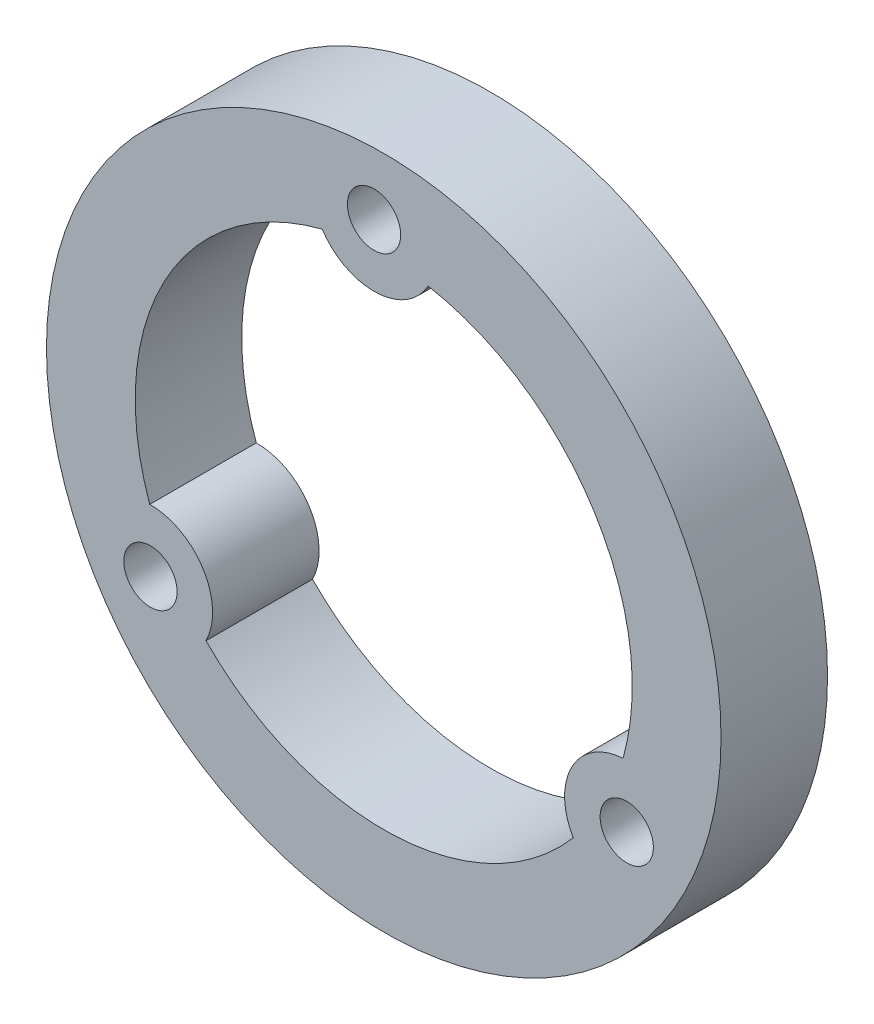
ISO-10303-21;
HEADER;
FILE_DESCRIPTION(('STEP AP214'),'2;1');
FILE_NAME('part.step','',(''),(''),'','','');
FILE_SCHEMA(('AUTOMOTIVE_DESIGN { 1 0 10303 214 1 1 1 1 }'));
ENDSEC;
DATA;
#1=APPLICATION_CONTEXT('core data for automotive mechanical design processes');
#2=APPLICATION_PROTOCOL_DEFINITION('international standard','automotive_design',2000,#1);
#3=PRODUCT_CONTEXT('',#1,'mechanical');
#4=PRODUCT('Part','Part','',(#3));
#5=PRODUCT_RELATED_PRODUCT_CATEGORY('part','',(#4));
#6=PRODUCT_DEFINITION_FORMATION('','',#4);
#7=PRODUCT_DEFINITION_CONTEXT('part definition',#1,'design');
#8=PRODUCT_DEFINITION('design','',#6,#7);
#9=PRODUCT_DEFINITION_SHAPE('','',#8);
#10=(LENGTH_UNIT() NAMED_UNIT(*) SI_UNIT(.MILLI.,.METRE.));
#11=(NAMED_UNIT(*) PLANE_ANGLE_UNIT() SI_UNIT($,.RADIAN.));
#12=(NAMED_UNIT(*) SI_UNIT($,.STERADIAN.) SOLID_ANGLE_UNIT());
#13=UNCERTAINTY_MEASURE_WITH_UNIT(LENGTH_MEASURE(1.E-05),#10,'distance_accuracy_value','');
#14=(GEOMETRIC_REPRESENTATION_CONTEXT(3) GLOBAL_UNCERTAINTY_ASSIGNED_CONTEXT((#13)) GLOBAL_UNIT_ASSIGNED_CONTEXT((#10,
#11,#12)) REPRESENTATION_CONTEXT('',''));
#15=CARTESIAN_POINT('',(0.,0.,0.));
#16=DIRECTION('',(0.,0.,1.));
#17=DIRECTION('',(1.,0.,0.));
#18=AXIS2_PLACEMENT_3D('',#15,#16,#17);
#19=CARTESIAN_POINT('',(0.,0.,6.));
#20=DIRECTION('',(0.,0.,1.));
#21=DIRECTION('',(1.,0.,0.));
#22=AXIS2_PLACEMENT_3D('',#19,#20,#21);
#23=PLANE('',#22);
#24=CARTESIAN_POINT('',(-13.1416847795504,-8.21864472738256,6.));
#25=DIRECTION('',(0.,0.,1.));
#26=DIRECTION('',(1.,0.,0.));
#27=AXIS2_PLACEMENT_3D('',#24,#25,#26);
#28=CIRCLE('',#27,1.5);
#29=CARTESIAN_POINT('',(-11.6416847795504,-8.21864472738256,6.));
#30=VERTEX_POINT('',#29);
#31=EDGE_CURVE('E246',#30,#30,#28,.T.);
#32=ORIENTED_EDGE('',*,*,#31,.F.);
#33=EDGE_LOOP('',(#32));
#34=FACE_BOUND('',#33,.T.);
#35=CARTESIAN_POINT('',(13.6883975083675,-7.2717105039268,6.));
#36=DIRECTION('',(0.,0.,-1.));
#37=DIRECTION('',(1.,0.,0.));
#38=AXIS2_PLACEMENT_3D('',#35,#36,#37);
#39=CIRCLE('',#38,3.5);
#40=CARTESIAN_POINT('',(10.6770331705431,-9.0554382928228,6.));
#41=VERTEX_POINT('',#40);
#42=CARTESIAN_POINT('',(13.4806381865757,-3.77788222191169,6.));
#43=VERTEX_POINT('',#42);
#44=EDGE_CURVE('E93',#41,#43,#39,.T.);
#45=ORIENTED_EDGE('',*,*,#44,.F.);
#46=CARTESIAN_POINT('',(0.,0.,6.));
#47=DIRECTION('',(0.,0.,1.));
#48=DIRECTION('',(1.,0.,0.));
#49=AXIS2_PLACEMENT_3D('',#46,#47,#48);
#50=CIRCLE('',#49,14.);
#51=CARTESIAN_POINT('',(-10.0120610699689,-9.78563401784541,6.));
#52=VERTEX_POINT('',#51);
#53=EDGE_CURVE('E85',#52,#41,#50,.T.);
#54=ORIENTED_EDGE('',*,*,#53,.F.);
#55=CARTESIAN_POINT('',(-13.1416847795504,-8.21864472738256,6.));
#56=DIRECTION('',(0.,0.,-1.));
#57=DIRECTION('',(1.,0.,0.));
#58=AXIS2_PLACEMENT_3D('',#55,#56,#57);
#59=CIRCLE('',#58,3.5);
#60=CARTESIAN_POINT('',(-13.1807561892585,-4.71886281632819,6.));
#61=VERTEX_POINT('',#60);
#62=EDGE_CURVE('E115',#61,#52,#59,.T.);
#63=ORIENTED_EDGE('',*,*,#62,.F.);
#64=CARTESIAN_POINT('',(0.,0.,6.));
#65=DIRECTION('',(0.,0.,1.));
#66=DIRECTION('',(1.,0.,0.));
#67=AXIS2_PLACEMENT_3D('',#64,#65,#66);
#68=CIRCLE('',#67,14.);
#69=CARTESIAN_POINT('',(-3.46857711660661,13.563516239757,6.));
#70=VERTEX_POINT('',#69);
#71=EDGE_CURVE('E113',#70,#61,#68,.T.);
#72=ORIENTED_EDGE('',*,*,#71,.F.);
#73=CARTESIAN_POINT('',(-0.546712728816841,15.4903552313092,6.));
#74=DIRECTION('',(0.,0.,-1.));
#75=DIRECTION('',(1.,0.,0.));
#76=AXIS2_PLACEMENT_3D('',#73,#74,#75);
#77=CIRCLE('',#76,3.5);
#78=CARTESIAN_POINT('',(2.5037230187155,13.7743011091508,6.));
#79=VERTEX_POINT('',#78);
#80=EDGE_CURVE('E108',#79,#70,#77,.T.);
#81=ORIENTED_EDGE('',*,*,#80,.F.);
#82=CARTESIAN_POINT('',(0.,0.,6.));
#83=DIRECTION('',(0.,0.,1.));
#84=DIRECTION('',(1.,0.,0.));
#85=AXIS2_PLACEMENT_3D('',#82,#83,#84);
#86=CIRCLE('',#85,14.);
#87=EDGE_CURVE('E106',#43,#79,#86,.T.);
#88=ORIENTED_EDGE('',*,*,#87,.F.);
#89=EDGE_LOOP('',(#45,#54,#63,#72,#81,#88));
#90=FACE_BOUND('',#89,.T.);
#91=CARTESIAN_POINT('',(0.,0.,6.));
#92=DIRECTION('',(0.,0.,1.));
#93=DIRECTION('',(1.,0.,0.));
#94=AXIS2_PLACEMENT_3D('',#91,#92,#93);
#95=CIRCLE('',#94,19.);
#96=CARTESIAN_POINT('',(19.,0.,6.));
#97=VERTEX_POINT('',#96);
#98=EDGE_CURVE('E11',#97,#97,#95,.T.);
#99=ORIENTED_EDGE('',*,*,#98,.T.);
#100=EDGE_LOOP('',(#99));
#101=FACE_BOUND('',#100,.T.);
#102=CARTESIAN_POINT('',(-0.546712728816841,15.4903552313092,6.));
#103=DIRECTION('',(0.,0.,1.));
#104=DIRECTION('',(1.,0.,0.));
#105=AXIS2_PLACEMENT_3D('',#102,#103,#104);
#106=CIRCLE('',#105,1.5);
#107=CARTESIAN_POINT('',(0.953287271183161,15.4903552313092,6.));
#108=VERTEX_POINT('',#107);
#109=EDGE_CURVE('E118',#108,#108,#106,.T.);
#110=ORIENTED_EDGE('',*,*,#109,.F.);
#111=EDGE_LOOP('',(#110));
#112=FACE_BOUND('',#111,.T.);
#113=CARTESIAN_POINT('',(13.6883975083675,-7.2717105039268,6.));
#114=DIRECTION('',(0.,0.,1.));
#115=DIRECTION('',(1.,0.,0.));
#116=AXIS2_PLACEMENT_3D('',#113,#114,#115);
#117=CIRCLE('',#116,1.5);
#118=CARTESIAN_POINT('',(15.1883975083675,-7.2717105039268,6.));
#119=VERTEX_POINT('',#118);
#120=EDGE_CURVE('E237',#119,#119,#117,.T.);
#121=ORIENTED_EDGE('',*,*,#120,.F.);
#122=EDGE_LOOP('',(#121));
#123=FACE_BOUND('',#122,.T.);
#124=ADVANCED_FACE('F32',(#34,#90,#101,#112,#123),#23,.T.);
#125=CARTESIAN_POINT('',(0.,0.,0.));
#126=DIRECTION('',(0.,0.,1.));
#127=DIRECTION('',(1.,0.,0.));
#128=AXIS2_PLACEMENT_3D('',#125,#126,#127);
#129=PLANE('',#128);
#130=CARTESIAN_POINT('',(0.,0.,0.));
#131=DIRECTION('',(0.,0.,1.));
#132=DIRECTION('',(1.,0.,0.));
#133=AXIS2_PLACEMENT_3D('',#130,#131,#132);
#134=CIRCLE('',#133,19.);
#135=CARTESIAN_POINT('',(19.,0.,0.));
#136=VERTEX_POINT('',#135);
#137=EDGE_CURVE('E36',#136,#136,#134,.T.);
#138=ORIENTED_EDGE('',*,*,#137,.F.);
#139=EDGE_LOOP('',(#138));
#140=FACE_BOUND('',#139,.T.);
#141=CARTESIAN_POINT('',(0.,0.,0.));
#142=DIRECTION('',(0.,0.,1.));
#143=DIRECTION('',(1.,0.,0.));
#144=AXIS2_PLACEMENT_3D('',#141,#142,#143);
#145=CIRCLE('',#144,14.);
#146=CARTESIAN_POINT('',(-10.0120610699689,-9.78563401784541,0.));
#147=VERTEX_POINT('',#146);
#148=CARTESIAN_POINT('',(10.6770331705431,-9.0554382928228,0.));
#149=VERTEX_POINT('',#148);
#150=EDGE_CURVE('E55',#147,#149,#145,.T.);
#151=ORIENTED_EDGE('',*,*,#150,.T.);
#152=CARTESIAN_POINT('',(13.6883975083675,-7.2717105039268,0.));
#153=DIRECTION('',(0.,0.,-1.));
#154=DIRECTION('',(1.,0.,0.));
#155=AXIS2_PLACEMENT_3D('',#152,#153,#154);
#156=CIRCLE('',#155,3.5);
#157=CARTESIAN_POINT('',(13.4806381865757,-3.77788222191169,0.));
#158=VERTEX_POINT('',#157);
#159=EDGE_CURVE('E100',#149,#158,#156,.T.);
#160=ORIENTED_EDGE('',*,*,#159,.T.);
#161=CARTESIAN_POINT('',(0.,0.,0.));
#162=DIRECTION('',(0.,0.,1.));
#163=DIRECTION('',(1.,0.,0.));
#164=AXIS2_PLACEMENT_3D('',#161,#162,#163);
#165=CIRCLE('',#164,14.);
#166=CARTESIAN_POINT('',(2.5037230187155,13.7743011091508,0.));
#167=VERTEX_POINT('',#166);
#168=EDGE_CURVE('E120',#158,#167,#165,.T.);
#169=ORIENTED_EDGE('',*,*,#168,.T.);
#170=CARTESIAN_POINT('',(-0.546712728816841,15.4903552313092,0.));
#171=DIRECTION('',(0.,0.,-1.));
#172=DIRECTION('',(1.,0.,0.));
#173=AXIS2_PLACEMENT_3D('',#170,#171,#172);
#174=CIRCLE('',#173,3.5);
#175=CARTESIAN_POINT('',(-3.46857711660661,13.563516239757,0.));
#176=VERTEX_POINT('',#175);
#177=EDGE_CURVE('E123',#167,#176,#174,.T.);
#178=ORIENTED_EDGE('',*,*,#177,.T.);
#179=CARTESIAN_POINT('',(0.,0.,0.));
#180=DIRECTION('',(0.,0.,1.));
#181=DIRECTION('',(1.,0.,0.));
#182=AXIS2_PLACEMENT_3D('',#179,#180,#181);
#183=CIRCLE('',#182,14.);
#184=CARTESIAN_POINT('',(-13.1807561892585,-4.71886281632818,0.));
#185=VERTEX_POINT('',#184);
#186=EDGE_CURVE('E126',#176,#185,#183,.T.);
#187=ORIENTED_EDGE('',*,*,#186,.T.);
#188=CARTESIAN_POINT('',(-13.1416847795504,-8.21864472738256,0.));
#189=DIRECTION('',(0.,0.,-1.));
#190=DIRECTION('',(1.,0.,0.));
#191=AXIS2_PLACEMENT_3D('',#188,#189,#190);
#192=CIRCLE('',#191,3.5);
#193=EDGE_CURVE('E94',#185,#147,#192,.T.);
#194=ORIENTED_EDGE('',*,*,#193,.T.);
#195=EDGE_LOOP('',(#151,#160,#169,#178,#187,#194));
#196=FACE_BOUND('',#195,.T.);
#197=CARTESIAN_POINT('',(-0.546712728816841,15.4903552313092,0.));
#198=DIRECTION('',(0.,0.,1.));
#199=DIRECTION('',(1.,0.,0.));
#200=AXIS2_PLACEMENT_3D('',#197,#198,#199);
#201=CIRCLE('',#200,1.5);
#202=CARTESIAN_POINT('',(0.953287271183161,15.4903552313092,0.));
#203=VERTEX_POINT('',#202);
#204=EDGE_CURVE('E249',#203,#203,#201,.T.);
#205=ORIENTED_EDGE('',*,*,#204,.T.);
#206=EDGE_LOOP('',(#205));
#207=FACE_BOUND('',#206,.T.);
#208=CARTESIAN_POINT('',(-13.1416847795504,-8.21864472738256,0.));
#209=DIRECTION('',(0.,0.,1.));
#210=DIRECTION('',(1.,0.,0.));
#211=AXIS2_PLACEMENT_3D('',#208,#209,#210);
#212=CIRCLE('',#211,1.5);
#213=CARTESIAN_POINT('',(-11.6416847795504,-8.21864472738256,0.));
#214=VERTEX_POINT('',#213);
#215=EDGE_CURVE('E243',#214,#214,#212,.T.);
#216=ORIENTED_EDGE('',*,*,#215,.T.);
#217=EDGE_LOOP('',(#216));
#218=FACE_BOUND('',#217,.T.);
#219=CARTESIAN_POINT('',(13.6883975083675,-7.2717105039268,0.));
#220=DIRECTION('',(0.,0.,1.));
#221=DIRECTION('',(1.,0.,0.));
#222=AXIS2_PLACEMENT_3D('',#219,#220,#221);
#223=CIRCLE('',#222,1.5);
#224=CARTESIAN_POINT('',(15.1883975083675,-7.2717105039268,0.));
#225=VERTEX_POINT('',#224);
#226=EDGE_CURVE('E240',#225,#225,#223,.T.);
#227=ORIENTED_EDGE('',*,*,#226,.T.);
#228=EDGE_LOOP('',(#227));
#229=FACE_BOUND('',#228,.T.);
#230=ADVANCED_FACE('F143',(#140,#196,#207,#218,#229),#129,.F.);
#231=CARTESIAN_POINT('',(0.,0.,6.));
#232=DIRECTION('',(0.,0.,-1.));
#233=DIRECTION('',(-1.,0.,0.));
#234=AXIS2_PLACEMENT_3D('',#231,#232,#233);
#235=CYLINDRICAL_SURFACE('',#234,19.);
#236=ORIENTED_EDGE('',*,*,#98,.F.);
#237=EDGE_LOOP('',(#236));
#238=FACE_BOUND('',#237,.T.);
#239=ORIENTED_EDGE('',*,*,#137,.T.);
#240=EDGE_LOOP('',(#239));
#241=FACE_BOUND('',#240,.T.);
#242=ADVANCED_FACE('F34',(#238,#241),#235,.T.);
#243=CARTESIAN_POINT('',(0.,0.,6.));
#244=DIRECTION('',(0.,0.,-1.));
#245=DIRECTION('',(-1.,0.,0.));
#246=AXIS2_PLACEMENT_3D('',#243,#244,#245);
#247=CYLINDRICAL_SURFACE('',#246,14.);
#248=ORIENTED_EDGE('',*,*,#150,.F.);
#249=DIRECTION('',(0.,0.,-1.));
#250=VECTOR('',#249,1.);
#251=CARTESIAN_POINT('',(-10.0120610699689,-9.78563401784541,6.));
#252=LINE('',#251,#250);
#253=EDGE_CURVE('E89',#52,#147,#252,.T.);
#254=ORIENTED_EDGE('',*,*,#253,.F.);
#255=ORIENTED_EDGE('',*,*,#53,.T.);
#256=DIRECTION('',(0.,0.,-1.));
#257=VECTOR('',#256,1.);
#258=CARTESIAN_POINT('',(10.6770331705431,-9.0554382928228,6.));
#259=LINE('',#258,#257);
#260=EDGE_CURVE('E88',#41,#149,#259,.T.);
#261=ORIENTED_EDGE('',*,*,#260,.T.);
#262=EDGE_LOOP('',(#248,#254,#255,#261));
#263=FACE_BOUND('',#262,.T.);
#264=ADVANCED_FACE('F87',(#263),#247,.F.);
#265=CARTESIAN_POINT('',(13.6883975083675,-7.2717105039268,6.));
#266=DIRECTION('',(0.,0.,-1.));
#267=DIRECTION('',(-1.,0.,0.));
#268=AXIS2_PLACEMENT_3D('',#265,#266,#267);
#269=CYLINDRICAL_SURFACE('',#268,3.5);
#270=ORIENTED_EDGE('',*,*,#159,.F.);
#271=ORIENTED_EDGE('',*,*,#260,.F.);
#272=ORIENTED_EDGE('',*,*,#44,.T.);
#273=DIRECTION('',(0.,0.,-1.));
#274=VECTOR('',#273,1.);
#275=CARTESIAN_POINT('',(13.4806381865757,-3.77788222191169,6.));
#276=LINE('',#275,#274);
#277=EDGE_CURVE('E101',#43,#158,#276,.T.);
#278=ORIENTED_EDGE('',*,*,#277,.T.);
#279=EDGE_LOOP('',(#270,#271,#272,#278));
#280=FACE_BOUND('',#279,.T.);
#281=ADVANCED_FACE('F97',(#280),#269,.T.);
#282=CARTESIAN_POINT('',(0.,0.,6.));
#283=DIRECTION('',(0.,0.,-1.));
#284=DIRECTION('',(-1.,0.,0.));
#285=AXIS2_PLACEMENT_3D('',#282,#283,#284);
#286=CYLINDRICAL_SURFACE('',#285,14.);
#287=ORIENTED_EDGE('',*,*,#168,.F.);
#288=ORIENTED_EDGE('',*,*,#277,.F.);
#289=ORIENTED_EDGE('',*,*,#87,.T.);
#290=DIRECTION('',(0.,0.,-1.));
#291=VECTOR('',#290,1.);
#292=CARTESIAN_POINT('',(2.5037230187155,13.7743011091508,6.));
#293=LINE('',#292,#291);
#294=EDGE_CURVE('E135',#79,#167,#293,.T.);
#295=ORIENTED_EDGE('',*,*,#294,.T.);
#296=EDGE_LOOP('',(#287,#288,#289,#295));
#297=FACE_BOUND('',#296,.T.);
#298=ADVANCED_FACE('F139',(#297),#286,.F.);
#299=CARTESIAN_POINT('',(-0.546712728816841,15.4903552313092,6.));
#300=DIRECTION('',(0.,0.,-1.));
#301=DIRECTION('',(-1.,0.,0.));
#302=AXIS2_PLACEMENT_3D('',#299,#300,#301);
#303=CYLINDRICAL_SURFACE('',#302,3.5);
#304=ORIENTED_EDGE('',*,*,#177,.F.);
#305=ORIENTED_EDGE('',*,*,#294,.F.);
#306=ORIENTED_EDGE('',*,*,#80,.T.);
#307=DIRECTION('',(0.,0.,-1.));
#308=VECTOR('',#307,1.);
#309=CARTESIAN_POINT('',(-3.46857711660661,13.563516239757,6.));
#310=LINE('',#309,#308);
#311=EDGE_CURVE('E133',#70,#176,#310,.T.);
#312=ORIENTED_EDGE('',*,*,#311,.T.);
#313=EDGE_LOOP('',(#304,#305,#306,#312));
#314=FACE_BOUND('',#313,.T.);
#315=ADVANCED_FACE('F152',(#314),#303,.T.);
#316=CARTESIAN_POINT('',(0.,0.,6.));
#317=DIRECTION('',(0.,0.,-1.));
#318=DIRECTION('',(-1.,0.,0.));
#319=AXIS2_PLACEMENT_3D('',#316,#317,#318);
#320=CYLINDRICAL_SURFACE('',#319,14.);
#321=ORIENTED_EDGE('',*,*,#186,.F.);
#322=ORIENTED_EDGE('',*,*,#311,.F.);
#323=ORIENTED_EDGE('',*,*,#71,.T.);
#324=DIRECTION('',(0.,0.,-1.));
#325=VECTOR('',#324,1.);
#326=CARTESIAN_POINT('',(-13.1807561892585,-4.71886281632818,6.));
#327=LINE('',#326,#325);
#328=EDGE_CURVE('E47',#61,#185,#327,.T.);
#329=ORIENTED_EDGE('',*,*,#328,.T.);
#330=EDGE_LOOP('',(#321,#322,#323,#329));
#331=FACE_BOUND('',#330,.T.);
#332=ADVANCED_FACE('F150',(#331),#320,.F.);
#333=CARTESIAN_POINT('',(-13.1416847795504,-8.21864472738256,6.));
#334=DIRECTION('',(0.,0.,-1.));
#335=DIRECTION('',(-1.,0.,0.));
#336=AXIS2_PLACEMENT_3D('',#333,#334,#335);
#337=CYLINDRICAL_SURFACE('',#336,3.5);
#338=ORIENTED_EDGE('',*,*,#193,.F.);
#339=ORIENTED_EDGE('',*,*,#328,.F.);
#340=ORIENTED_EDGE('',*,*,#62,.T.);
#341=ORIENTED_EDGE('',*,*,#253,.T.);
#342=EDGE_LOOP('',(#338,#339,#340,#341));
#343=FACE_BOUND('',#342,.T.);
#344=ADVANCED_FACE('F146',(#343),#337,.T.);
#345=CARTESIAN_POINT('',(-0.546712728816841,15.4903552313092,6.));
#346=DIRECTION('',(0.,0.,-1.));
#347=DIRECTION('',(-1.,0.,0.));
#348=AXIS2_PLACEMENT_3D('',#345,#346,#347);
#349=CYLINDRICAL_SURFACE('',#348,1.5);
#350=ORIENTED_EDGE('',*,*,#109,.T.);
#351=EDGE_LOOP('',(#350));
#352=FACE_BOUND('',#351,.T.);
#353=ORIENTED_EDGE('',*,*,#204,.F.);
#354=EDGE_LOOP('',(#353));
#355=FACE_BOUND('',#354,.T.);
#356=ADVANCED_FACE('F201',(#352,#355),#349,.F.);
#357=CARTESIAN_POINT('',(-13.1416847795504,-8.21864472738256,6.));
#358=DIRECTION('',(0.,0.,-1.));
#359=DIRECTION('',(-1.,0.,0.));
#360=AXIS2_PLACEMENT_3D('',#357,#358,#359);
#361=CYLINDRICAL_SURFACE('',#360,1.5);
#362=ORIENTED_EDGE('',*,*,#31,.T.);
#363=EDGE_LOOP('',(#362));
#364=FACE_BOUND('',#363,.T.);
#365=ORIENTED_EDGE('',*,*,#215,.F.);
#366=EDGE_LOOP('',(#365));
#367=FACE_BOUND('',#366,.T.);
#368=ADVANCED_FACE('F210',(#364,#367),#361,.F.);
#369=CARTESIAN_POINT('',(13.6883975083675,-7.2717105039268,6.));
#370=DIRECTION('',(0.,0.,-1.));
#371=DIRECTION('',(-1.,0.,0.));
#372=AXIS2_PLACEMENT_3D('',#369,#370,#371);
#373=CYLINDRICAL_SURFACE('',#372,1.5);
#374=ORIENTED_EDGE('',*,*,#120,.T.);
#375=EDGE_LOOP('',(#374));
#376=FACE_BOUND('',#375,.T.);
#377=ORIENTED_EDGE('',*,*,#226,.F.);
#378=EDGE_LOOP('',(#377));
#379=FACE_BOUND('',#378,.T.);
#380=ADVANCED_FACE('F220',(#376,#379),#373,.F.);
#381=CLOSED_SHELL('',(#124,#230,#242,#264,#281,#298,#315,#332,#344,#356,#368,#380));
#382=MANIFOLD_SOLID_BREP('B2',#381);
#383=ADVANCED_BREP_SHAPE_REPRESENTATION('',(#18,#382),#14);
#384=SHAPE_DEFINITION_REPRESENTATION(#9,#383);
ENDSEC;
END-ISO-10303-21;
